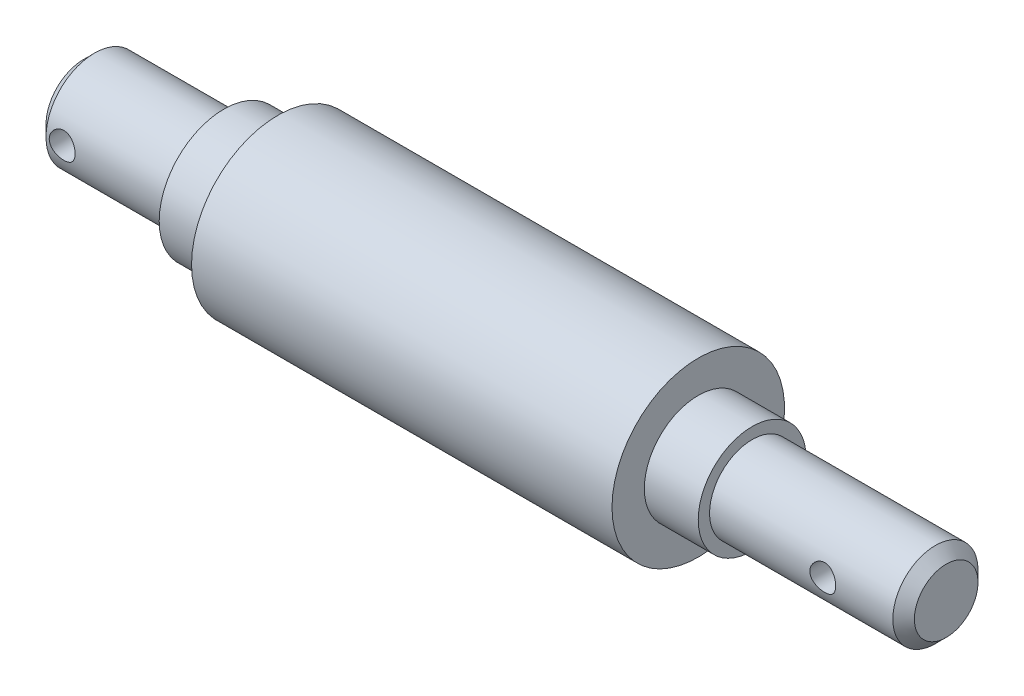
ISO-10303-21;
HEADER;
FILE_DESCRIPTION(('STEP AP214'),'2;1');
FILE_NAME('part.step','',(''),(''),'','','');
FILE_SCHEMA(('AUTOMOTIVE_DESIGN { 1 0 10303 214 1 1 1 1 }'));
ENDSEC;
DATA;
#1=APPLICATION_CONTEXT('core data for automotive mechanical design processes');
#2=APPLICATION_PROTOCOL_DEFINITION('international standard','automotive_design',2000,#1);
#3=PRODUCT_CONTEXT('',#1,'mechanical');
#4=PRODUCT('Part','Part','',(#3));
#5=PRODUCT_RELATED_PRODUCT_CATEGORY('part','',(#4));
#6=PRODUCT_DEFINITION_FORMATION('','',#4);
#7=PRODUCT_DEFINITION_CONTEXT('part definition',#1,'design');
#8=PRODUCT_DEFINITION('design','',#6,#7);
#9=PRODUCT_DEFINITION_SHAPE('','',#8);
#10=(LENGTH_UNIT() NAMED_UNIT(*) SI_UNIT(.MILLI.,.METRE.));
#11=(NAMED_UNIT(*) PLANE_ANGLE_UNIT() SI_UNIT($,.RADIAN.));
#12=(NAMED_UNIT(*) SI_UNIT($,.STERADIAN.) SOLID_ANGLE_UNIT());
#13=UNCERTAINTY_MEASURE_WITH_UNIT(LENGTH_MEASURE(1.E-05),#10,'distance_accuracy_value','');
#14=(GEOMETRIC_REPRESENTATION_CONTEXT(3) GLOBAL_UNCERTAINTY_ASSIGNED_CONTEXT((#13)) GLOBAL_UNIT_ASSIGNED_CONTEXT((#10,
#11,#12)) REPRESENTATION_CONTEXT('',''));
#15=CARTESIAN_POINT('',(0.,0.,0.));
#16=DIRECTION('',(0.,0.,1.));
#17=DIRECTION('',(1.,0.,0.));
#18=AXIS2_PLACEMENT_3D('',#15,#16,#17);
#19=CARTESIAN_POINT('',(-41.319098712356,0.,0.));
#20=DIRECTION('',(1.,0.,0.));
#21=DIRECTION('',(0.,0.,-1.));
#22=AXIS2_PLACEMENT_3D('',#19,#20,#21);
#23=PLANE('',#22);
#24=CARTESIAN_POINT('',(-41.319098712356,0.,0.));
#25=DIRECTION('',(1.,0.,0.));
#26=DIRECTION('',(0.,0.,-1.));
#27=AXIS2_PLACEMENT_3D('',#24,#25,#26);
#28=CIRCLE('',#27,3.49999999999999);
#29=CARTESIAN_POINT('',(-41.319098712356,0.,-3.49999999999999));
#30=VERTEX_POINT('',#29);
#31=EDGE_CURVE('E171',#30,#30,#28,.F.);
#32=ORIENTED_EDGE('',*,*,#31,.T.);
#33=EDGE_LOOP('',(#32));
#34=FACE_BOUND('',#33,.T.);
#35=ADVANCED_FACE('F39',(#34),#23,.F.);
#36=CARTESIAN_POINT('',(-41.319098712356,0.,0.));
#37=DIRECTION('',(-1.,0.,0.));
#38=DIRECTION('',(0.,0.,1.));
#39=AXIS2_PLACEMENT_3D('',#36,#37,#38);
#40=CYLINDRICAL_SURFACE('',#39,4.5);
#41=CARTESIAN_POINT('',(-37.619098712356,0.,4.5));
#42=CARTESIAN_POINT('',(-37.6191002825169,-0.0661527334997126,4.49999900286097));
#43=CARTESIAN_POINT('',(-37.6245872808698,-0.132322296133104,4.49852691697293));
#44=CARTESIAN_POINT('',(-37.6463514507992,-0.262755270812679,4.49279744172994));
#45=CARTESIAN_POINT('',(-37.6626338150117,-0.327017749991453,4.48853871199544));
#46=CARTESIAN_POINT('',(-37.7054217124744,-0.451734953427189,4.47770599951682));
#47=CARTESIAN_POINT('',(-37.7319140649556,-0.512194470609173,4.47113500278253));
#48=CARTESIAN_POINT('',(-37.794321057956,-0.627812211835596,4.45637219490979));
#49=CARTESIAN_POINT('',(-37.8302363263716,-0.682970082269774,4.44818027577004));
#50=CARTESIAN_POINT('',(-37.9113488222041,-0.787697702244017,4.43084768941303));
#51=CARTESIAN_POINT('',(-37.9567239131611,-0.83712701391769,4.4216908060761));
#52=CARTESIAN_POINT('',(-38.0550878021939,-0.92777228196381,4.40356445807354));
#53=CARTESIAN_POINT('',(-38.1080775789261,-0.968987180973926,4.39459501766848));
#54=CARTESIAN_POINT('',(-38.2212876532518,-1.04271845546055,4.37769322480147));
#55=CARTESIAN_POINT('',(-38.2816165093149,-1.07507326641916,4.36978133143675));
#56=CARTESIAN_POINT('',(-38.4071027790097,-1.12912528846172,4.35612886385181));
#57=CARTESIAN_POINT('',(-38.4722592997482,-1.15082446470732,4.3503878893056));
#58=CARTESIAN_POINT('',(-38.603996035052,-1.18246152135855,4.34189469502391));
#59=CARTESIAN_POINT('',(-38.6705108363273,-1.19265402146962,4.33907788764184));
#60=CARTESIAN_POINT('',(-38.8043613223558,-1.20178220823656,4.33655898626814));
#61=CARTESIAN_POINT('',(-38.8716968513774,-1.20071999823441,4.33685631029042));
#62=CARTESIAN_POINT('',(-39.0032899615794,-1.18757106001573,4.34047427261428));
#63=CARTESIAN_POINT('',(-39.0675810215788,-1.17579243638846,4.34371041301614));
#64=CARTESIAN_POINT('',(-39.19323971303,-1.14203849233322,4.35270607853718));
#65=CARTESIAN_POINT('',(-39.2546071104013,-1.120062356958,4.35846580532997));
#66=CARTESIAN_POINT('',(-39.3734795986411,-1.0662861417915,4.37193397047586));
#67=CARTESIAN_POINT('',(-39.4309333159278,-1.0343780468267,4.37966365690834));
#68=CARTESIAN_POINT('',(-39.539779207667,-0.961719022942674,4.39618937785855));
#69=CARTESIAN_POINT('',(-39.5911701858499,-0.920966353345509,4.40498562213217));
#70=CARTESIAN_POINT('',(-39.6881921108289,-0.830199643580509,4.42300506377809));
#71=CARTESIAN_POINT('',(-39.733580503345,-0.779926876369793,4.43223282893269));
#72=CARTESIAN_POINT('',(-39.8153319805662,-0.672370600923823,4.44981828765819));
#73=CARTESIAN_POINT('',(-39.8516947095775,-0.615086816523053,4.45817594693141));
#74=CARTESIAN_POINT('',(-39.9144694540508,-0.494758953298469,4.47313092238968));
#75=CARTESIAN_POINT('',(-39.9408375746252,-0.431690941531073,4.47972043700134));
#76=CARTESIAN_POINT('',(-39.982527025644,-0.301801376634237,4.49034026640601));
#77=CARTESIAN_POINT('',(-39.9978507699904,-0.234980647156994,4.4943711404025));
#78=CARTESIAN_POINT('',(-40.0166356385067,-0.101552449887308,4.4993349513503));
#79=CARTESIAN_POINT('',(-40.0204265362665,-0.0349945425848269,4.50035398482577));
#80=CARTESIAN_POINT('',(-40.0169488138079,0.0978060275407194,4.49942683015015));
#81=CARTESIAN_POINT('',(-40.0096813366926,0.164048722237267,4.49748094848206));
#82=CARTESIAN_POINT('',(-39.98456364388,0.29316146994107,4.49089821297618));
#83=CARTESIAN_POINT('',(-39.9668973646373,0.356069911216676,4.4863081592782));
#84=CARTESIAN_POINT('',(-39.9216971456513,0.478024182705637,4.47495776936461));
#85=CARTESIAN_POINT('',(-39.8941621366057,0.5370695935296,4.46819719797615));
#86=CARTESIAN_POINT('',(-39.8293943800476,0.65090308480079,4.45305396335801));
#87=CARTESIAN_POINT('',(-39.7919822322772,0.705585113076781,4.4446421196329));
#88=CARTESIAN_POINT('',(-39.7087477342614,0.808010781238218,4.42716871419022));
#89=CARTESIAN_POINT('',(-39.6629237227962,0.855753047279247,4.41810702435333));
#90=CARTESIAN_POINT('',(-39.5626273658585,0.944333546872912,4.40003847521235));
#91=CARTESIAN_POINT('',(-39.5079475755159,0.984939115499913,4.39104036862172));
#92=CARTESIAN_POINT('',(-39.3923598946992,1.05640314710969,4.37439868305052));
#93=CARTESIAN_POINT('',(-39.3314522641938,1.08726201672916,4.36675504756664));
#94=CARTESIAN_POINT('',(-39.2054415281031,1.13812446951892,4.3537756104099));
#95=CARTESIAN_POINT('',(-39.1403652252321,1.15819087353539,4.3484264905424));
#96=CARTESIAN_POINT('',(-39.0075951205157,1.18704723072476,4.34063895139314));
#97=CARTESIAN_POINT('',(-38.9399019921358,1.19584006561793,4.33819978828692));
#98=CARTESIAN_POINT('',(-38.8062018396325,1.20173393791952,4.33657046728011));
#99=CARTESIAN_POINT('',(-38.7402123202029,1.19920893370791,4.33727638641619));
#100=CARTESIAN_POINT('',(-38.6096366039482,1.18340625600337,4.34161437652976));
#101=CARTESIAN_POINT('',(-38.5450503710552,1.17012885921035,4.34524637220818));
#102=CARTESIAN_POINT('',(-38.4195852610786,1.133415094198,4.35496542642749));
#103=CARTESIAN_POINT('',(-38.3586816067168,1.11005796645342,4.36103331011479));
#104=CARTESIAN_POINT('',(-38.2416114140354,1.05390932737436,4.37494090882014));
#105=CARTESIAN_POINT('',(-38.1854456205757,1.02111633614771,4.38278090172902));
#106=CARTESIAN_POINT('',(-38.0776604966581,0.945893455612883,4.3996375286419));
#107=CARTESIAN_POINT('',(-38.0262235913703,0.903208378607449,4.40868199860991));
#108=CARTESIAN_POINT('',(-37.9311212413556,0.8098983210666,4.42677302269828));
#109=CARTESIAN_POINT('',(-37.8874576891547,0.759271412615244,4.43581957679071));
#110=CARTESIAN_POINT('',(-37.8082233697679,0.650207988653203,4.45312687442375));
#111=CARTESIAN_POINT('',(-37.7728457059664,0.59162757705106,4.46136666788729));
#112=CARTESIAN_POINT('',(-37.7124962627984,0.469133184250127,4.4759028606174));
#113=CARTESIAN_POINT('',(-37.6875178069578,0.405222656817772,4.48220050610157));
#114=CARTESIAN_POINT('',(-37.6519335411067,0.28462482292859,4.4913285150808));
#115=CARTESIAN_POINT('',(-37.6396490822005,0.228457209939017,4.49455662355561));
#116=CARTESIAN_POINT('',(-37.6232313886558,0.114863877190244,4.49889269421873));
#117=CARTESIAN_POINT('',(-37.619097349036,0.0574382822429151,4.50000086578362));
#118=CARTESIAN_POINT('',(-37.619098712356,0.,4.5));
#119=B_SPLINE_CURVE_WITH_KNOTS('',3,(#41,#42,#43,#44,#45,#46,#47,#48,#49,#50,#51,#52,#53,#54,
#55,#56,#57,#58,#59,#60,#61,#62,#63,#64,#65,#66,#67,#68,#69,#70,#71,#72,#73,#74,#75,#76,#77,#78,
#79,#80,#81,#82,#83,#84,#85,#86,#87,#88,#89,#90,#91,#92,#93,#94,#95,#96,#97,#98,#99,#100,#101,
#102,#103,#104,#105,#106,#107,#108,#109,#110,#111,#112,#113,#114,#115,#116,#117,#118),
.UNSPECIFIED.,.T.,.F.,(4,2,2,2,2,2,2,2,2,2,2,2,2,2,2,2,2,2,2,2,2,2,2,2,2,2,2,2,2,2,2,2,2,2,2,2,
2,2,4),(0.,0.198247559369741,0.396590546256871,0.594678331783162,0.792779320252053,
0.995009387729807,1.19726546955089,1.40299549513937,1.6086875647782,1.80973294948553,
2.01074076239091,2.20614601224097,2.40156688084263,2.59919204004398,2.79685612867077,
3.00096755883892,3.20508703159057,3.41009285758324,3.61505386310582,3.81409630511227,
4.01311817351709,4.20872121381768,4.40434545461868,4.60380171599229,4.80329740951831,
5.00841897826171,5.21353198810963,5.41743778614894,5.62129145192296,5.81846005436074,
6.01562358306263,6.21126459262889,6.40693630267708,6.6083660373674,6.80984474593376,
7.01563351362446,7.22128995681015,7.39343891389909,7.56557086773736),.UNSPECIFIED.);
#120=CARTESIAN_POINT('',(-37.619098712356,0.,4.5));
#121=VERTEX_POINT('',#120);
#122=EDGE_CURVE('E44',#121,#121,#119,.T.);
#123=ORIENTED_EDGE('',*,*,#122,.T.);
#124=EDGE_LOOP('',(#123));
#125=FACE_BOUND('',#124,.T.);
#126=CARTESIAN_POINT('',(-37.619098712356,0.,-4.5));
#127=CARTESIAN_POINT('',(-37.6191002825169,0.0661527334997126,-4.49999900286097));
#128=CARTESIAN_POINT('',(-37.6245872808698,0.132322296133104,-4.49852691697293));
#129=CARTESIAN_POINT('',(-37.6463514507992,0.262755270812679,-4.49279744172994));
#130=CARTESIAN_POINT('',(-37.6626338150117,0.327017749991453,-4.48853871199544));
#131=CARTESIAN_POINT('',(-37.7054217124744,0.451734953427189,-4.47770599951682));
#132=CARTESIAN_POINT('',(-37.7319140649556,0.512194470609173,-4.47113500278253));
#133=CARTESIAN_POINT('',(-37.794321057956,0.627812211835596,-4.45637219490979));
#134=CARTESIAN_POINT('',(-37.8302363263716,0.682970082269774,-4.44818027577004));
#135=CARTESIAN_POINT('',(-37.9113488222041,0.787697702244017,-4.43084768941303));
#136=CARTESIAN_POINT('',(-37.9567239131611,0.83712701391769,-4.4216908060761));
#137=CARTESIAN_POINT('',(-38.0550878021939,0.92777228196381,-4.40356445807354));
#138=CARTESIAN_POINT('',(-38.1080775789261,0.968987180973926,-4.39459501766848));
#139=CARTESIAN_POINT('',(-38.2212876532518,1.04271845546055,-4.37769322480147));
#140=CARTESIAN_POINT('',(-38.2816165093149,1.07507326641916,-4.36978133143675));
#141=CARTESIAN_POINT('',(-38.4071027790097,1.12912528846172,-4.35612886385181));
#142=CARTESIAN_POINT('',(-38.4722592997482,1.15082446470732,-4.3503878893056));
#143=CARTESIAN_POINT('',(-38.603996035052,1.18246152135855,-4.34189469502391));
#144=CARTESIAN_POINT('',(-38.6705108363273,1.19265402146962,-4.33907788764184));
#145=CARTESIAN_POINT('',(-38.8043613223558,1.20178220823656,-4.33655898626814));
#146=CARTESIAN_POINT('',(-38.8716968513774,1.20071999823441,-4.33685631029042));
#147=CARTESIAN_POINT('',(-39.0032899615794,1.18757106001573,-4.34047427261428));
#148=CARTESIAN_POINT('',(-39.0675810215788,1.17579243638846,-4.34371041301614));
#149=CARTESIAN_POINT('',(-39.19323971303,1.14203849233322,-4.35270607853718));
#150=CARTESIAN_POINT('',(-39.2546071104013,1.120062356958,-4.35846580532997));
#151=CARTESIAN_POINT('',(-39.3734795986411,1.0662861417915,-4.37193397047586));
#152=CARTESIAN_POINT('',(-39.4309333159278,1.0343780468267,-4.37966365690834));
#153=CARTESIAN_POINT('',(-39.539779207667,0.961719022942674,-4.39618937785855));
#154=CARTESIAN_POINT('',(-39.5911701858499,0.920966353345509,-4.40498562213217));
#155=CARTESIAN_POINT('',(-39.6881921108289,0.830199643580509,-4.42300506377809));
#156=CARTESIAN_POINT('',(-39.733580503345,0.779926876369793,-4.43223282893269));
#157=CARTESIAN_POINT('',(-39.8153319805662,0.672370600923823,-4.44981828765819));
#158=CARTESIAN_POINT('',(-39.8516947095775,0.615086816523053,-4.45817594693141));
#159=CARTESIAN_POINT('',(-39.9144694540508,0.494758953298469,-4.47313092238968));
#160=CARTESIAN_POINT('',(-39.9408375746252,0.431690941531073,-4.47972043700134));
#161=CARTESIAN_POINT('',(-39.982527025644,0.301801376634237,-4.49034026640601));
#162=CARTESIAN_POINT('',(-39.9978507699904,0.234980647156994,-4.4943711404025));
#163=CARTESIAN_POINT('',(-40.0166356385067,0.101552449887308,-4.4993349513503));
#164=CARTESIAN_POINT('',(-40.0204265362665,0.0349945425848269,-4.50035398482577));
#165=CARTESIAN_POINT('',(-40.0169488138079,-0.0978060275407194,-4.49942683015015));
#166=CARTESIAN_POINT('',(-40.0096813366926,-0.164048722237267,-4.49748094848206));
#167=CARTESIAN_POINT('',(-39.98456364388,-0.29316146994107,-4.49089821297618));
#168=CARTESIAN_POINT('',(-39.9668973646373,-0.356069911216676,-4.4863081592782));
#169=CARTESIAN_POINT('',(-39.9216971456513,-0.478024182705637,-4.47495776936461));
#170=CARTESIAN_POINT('',(-39.8941621366057,-0.5370695935296,-4.46819719797615));
#171=CARTESIAN_POINT('',(-39.8293943800476,-0.65090308480079,-4.45305396335801));
#172=CARTESIAN_POINT('',(-39.7919822322772,-0.705585113076781,-4.4446421196329));
#173=CARTESIAN_POINT('',(-39.7087477342614,-0.808010781238218,-4.42716871419022));
#174=CARTESIAN_POINT('',(-39.6629237227962,-0.855753047279247,-4.41810702435333));
#175=CARTESIAN_POINT('',(-39.5626273658585,-0.944333546872912,-4.40003847521235));
#176=CARTESIAN_POINT('',(-39.5079475755159,-0.984939115499913,-4.39104036862172));
#177=CARTESIAN_POINT('',(-39.3923598946992,-1.05640314710969,-4.37439868305052));
#178=CARTESIAN_POINT('',(-39.3314522641938,-1.08726201672916,-4.36675504756664));
#179=CARTESIAN_POINT('',(-39.2054415281031,-1.13812446951892,-4.3537756104099));
#180=CARTESIAN_POINT('',(-39.1403652252321,-1.15819087353539,-4.3484264905424));
#181=CARTESIAN_POINT('',(-39.0075951205157,-1.18704723072476,-4.34063895139314));
#182=CARTESIAN_POINT('',(-38.9399019921358,-1.19584006561793,-4.33819978828692));
#183=CARTESIAN_POINT('',(-38.8062018396325,-1.20173393791952,-4.33657046728011));
#184=CARTESIAN_POINT('',(-38.7402123202029,-1.19920893370791,-4.33727638641619));
#185=CARTESIAN_POINT('',(-38.6096366039482,-1.18340625600337,-4.34161437652976));
#186=CARTESIAN_POINT('',(-38.5450503710552,-1.17012885921035,-4.34524637220818));
#187=CARTESIAN_POINT('',(-38.4195852610786,-1.133415094198,-4.35496542642749));
#188=CARTESIAN_POINT('',(-38.3586816067168,-1.11005796645342,-4.36103331011479));
#189=CARTESIAN_POINT('',(-38.2416114140354,-1.05390932737436,-4.37494090882014));
#190=CARTESIAN_POINT('',(-38.1854456205757,-1.02111633614771,-4.38278090172902));
#191=CARTESIAN_POINT('',(-38.0776604966581,-0.945893455612883,-4.3996375286419));
#192=CARTESIAN_POINT('',(-38.0262235913703,-0.903208378607449,-4.40868199860991));
#193=CARTESIAN_POINT('',(-37.9311212413556,-0.8098983210666,-4.42677302269828));
#194=CARTESIAN_POINT('',(-37.8874576891547,-0.759271412615244,-4.43581957679071));
#195=CARTESIAN_POINT('',(-37.8082233697679,-0.650207988653203,-4.45312687442375));
#196=CARTESIAN_POINT('',(-37.7728457059664,-0.59162757705106,-4.46136666788729));
#197=CARTESIAN_POINT('',(-37.7124962627984,-0.469133184250127,-4.4759028606174));
#198=CARTESIAN_POINT('',(-37.6875178069578,-0.405222656817772,-4.48220050610157));
#199=CARTESIAN_POINT('',(-37.6519335411067,-0.28462482292859,-4.4913285150808));
#200=CARTESIAN_POINT('',(-37.6396490822005,-0.228457209939017,-4.49455662355561));
#201=CARTESIAN_POINT('',(-37.6232313886558,-0.114863877190244,-4.49889269421873));
#202=CARTESIAN_POINT('',(-37.619097349036,-0.0574382822429151,-4.50000086578362));
#203=CARTESIAN_POINT('',(-37.619098712356,0.,-4.5));
#204=B_SPLINE_CURVE_WITH_KNOTS('',3,(#126,#127,#128,#129,#130,#131,#132,#133,#134,#135,#136,
#137,#138,#139,#140,#141,#142,#143,#144,#145,#146,#147,#148,#149,#150,#151,#152,#153,#154,#155,
#156,#157,#158,#159,#160,#161,#162,#163,#164,#165,#166,#167,#168,#169,#170,#171,#172,#173,#174,
#175,#176,#177,#178,#179,#180,#181,#182,#183,#184,#185,#186,#187,#188,#189,#190,#191,#192,#193,
#194,#195,#196,#197,#198,#199,#200,#201,#202,#203),.UNSPECIFIED.,.T.,.F.,(4,2,2,2,2,2,2,2,2,2,2,
2,2,2,2,2,2,2,2,2,2,2,2,2,2,2,2,2,2,2,2,2,2,2,2,2,2,2,4),(0.,0.198247559369741,
0.396590546256871,0.594678331783162,0.792779320252053,0.995009387729807,1.19726546955089,
1.40299549513937,1.6086875647782,1.80973294948553,2.01074076239091,2.20614601224097,
2.40156688084263,2.59919204004398,2.79685612867077,3.00096755883892,3.20508703159057,
3.41009285758324,3.61505386310582,3.81409630511227,4.01311817351709,4.20872121381768,
4.40434545461868,4.60380171599229,4.80329740951831,5.00841897826171,5.21353198810963,
5.41743778614894,5.62129145192296,5.81846005436074,6.01562358306263,6.21126459262889,
6.40693630267708,6.6083660373674,6.80984474593376,7.01563351362446,7.22128995681015,
7.39343891389909,7.56557086773736),.UNSPECIFIED.);
#205=CARTESIAN_POINT('',(-37.619098712356,0.,-4.5));
#206=VERTEX_POINT('',#205);
#207=EDGE_CURVE('E117',#206,#206,#204,.T.);
#208=ORIENTED_EDGE('',*,*,#207,.T.);
#209=EDGE_LOOP('',(#208));
#210=FACE_BOUND('',#209,.T.);
#211=CARTESIAN_POINT('',(-40.319098712356,0.,0.));
#212=DIRECTION('',(1.,0.,0.));
#213=DIRECTION('',(0.,0.,-1.));
#214=AXIS2_PLACEMENT_3D('',#211,#212,#213);
#215=CIRCLE('',#214,4.5);
#216=CARTESIAN_POINT('',(-40.319098712356,0.,-4.5));
#217=VERTEX_POINT('',#216);
#218=EDGE_CURVE('E60',#217,#217,#215,.T.);
#219=ORIENTED_EDGE('',*,*,#218,.T.);
#220=EDGE_LOOP('',(#219));
#221=FACE_BOUND('',#220,.T.);
#222=CARTESIAN_POINT('',(-28.3334978231815,0.,0.));
#223=DIRECTION('',(-1.,0.,0.));
#224=DIRECTION('',(0.,0.,1.));
#225=AXIS2_PLACEMENT_3D('',#222,#223,#224);
#226=CIRCLE('',#225,4.5);
#227=CARTESIAN_POINT('',(-28.3334978231815,0.,4.5));
#228=VERTEX_POINT('',#227);
#229=EDGE_CURVE('E167',#228,#228,#226,.T.);
#230=ORIENTED_EDGE('',*,*,#229,.T.);
#231=EDGE_LOOP('',(#230));
#232=FACE_BOUND('',#231,.T.);
#233=ADVANCED_FACE('F99',(#125,#210,#221,#232),#40,.T.);
#234=CARTESIAN_POINT('',(-28.319098712356,0.,0.));
#235=DIRECTION('',(1.,0.,0.));
#236=DIRECTION('',(0.,0.,-1.));
#237=AXIS2_PLACEMENT_3D('',#234,#235,#236);
#238=CONICAL_SURFACE('',#237,5.99993088694361,1.56119677214311);
#239=ORIENTED_EDGE('',*,*,#229,.F.);
#240=EDGE_LOOP('',(#239));
#241=FACE_BOUND('',#240,.T.);
#242=CARTESIAN_POINT('',(-28.319098712356,0.,0.));
#243=DIRECTION('',(-1.,0.,0.));
#244=DIRECTION('',(0.,0.,1.));
#245=AXIS2_PLACEMENT_3D('',#242,#243,#244);
#246=CIRCLE('',#245,5.99993088694361);
#247=CARTESIAN_POINT('',(-28.319098712356,0.,5.99993088694361));
#248=VERTEX_POINT('',#247);
#249=EDGE_CURVE('E163',#248,#248,#246,.T.);
#250=ORIENTED_EDGE('',*,*,#249,.T.);
#251=EDGE_LOOP('',(#250));
#252=FACE_BOUND('',#251,.T.);
#253=ADVANCED_FACE('F105',(#241,#252),#238,.T.);
#254=CARTESIAN_POINT('',(-41.319098712356,0.,0.));
#255=DIRECTION('',(-1.,0.,0.));
#256=DIRECTION('',(0.,0.,1.));
#257=AXIS2_PLACEMENT_3D('',#254,#255,#256);
#258=CYLINDRICAL_SURFACE('',#257,5.99993088694361);
#259=ORIENTED_EDGE('',*,*,#249,.F.);
#260=EDGE_LOOP('',(#259));
#261=FACE_BOUND('',#260,.T.);
#262=CARTESIAN_POINT('',(-23.319098712356,0.,0.));
#263=DIRECTION('',(-1.,0.,0.));
#264=DIRECTION('',(0.,0.,1.));
#265=AXIS2_PLACEMENT_3D('',#262,#263,#264);
#266=CIRCLE('',#265,5.99993088694361);
#267=CARTESIAN_POINT('',(-23.319098712356,0.,5.99993088694361));
#268=VERTEX_POINT('',#267);
#269=EDGE_CURVE('E159',#268,#268,#266,.T.);
#270=ORIENTED_EDGE('',*,*,#269,.T.);
#271=EDGE_LOOP('',(#270));
#272=FACE_BOUND('',#271,.T.);
#273=ADVANCED_FACE('F184',(#261,#272),#258,.T.);
#274=CARTESIAN_POINT('',(-23.319098712356,5.99993088694361,0.));
#275=DIRECTION('',(1.,0.,0.));
#276=DIRECTION('',(0.,0.,-1.));
#277=AXIS2_PLACEMENT_3D('',#274,#275,#276);
#278=PLANE('',#277);
#279=ORIENTED_EDGE('',*,*,#269,.F.);
#280=EDGE_LOOP('',(#279));
#281=FACE_BOUND('',#280,.T.);
#282=CARTESIAN_POINT('',(-23.319098712356,0.,0.));
#283=DIRECTION('',(-1.,0.,0.));
#284=DIRECTION('',(0.,0.,1.));
#285=AXIS2_PLACEMENT_3D('',#282,#283,#284);
#286=CIRCLE('',#285,8.);
#287=CARTESIAN_POINT('',(-23.319098712356,0.,8.));
#288=VERTEX_POINT('',#287);
#289=EDGE_CURVE('E155',#288,#288,#286,.T.);
#290=ORIENTED_EDGE('',*,*,#289,.T.);
#291=EDGE_LOOP('',(#290));
#292=FACE_BOUND('',#291,.T.);
#293=ADVANCED_FACE('F189',(#281,#292),#278,.F.);
#294=CARTESIAN_POINT('',(-41.319098712356,0.,0.));
#295=DIRECTION('',(-1.,0.,0.));
#296=DIRECTION('',(0.,0.,1.));
#297=AXIS2_PLACEMENT_3D('',#294,#295,#296);
#298=CYLINDRICAL_SURFACE('',#297,8.);
#299=ORIENTED_EDGE('',*,*,#289,.F.);
#300=EDGE_LOOP('',(#299));
#301=FACE_BOUND('',#300,.T.);
#302=CARTESIAN_POINT('',(15.680901287644,0.,0.));
#303=DIRECTION('',(-1.,0.,0.));
#304=DIRECTION('',(0.,0.,1.));
#305=AXIS2_PLACEMENT_3D('',#302,#303,#304);
#306=CIRCLE('',#305,8.);
#307=CARTESIAN_POINT('',(15.680901287644,0.,8.));
#308=VERTEX_POINT('',#307);
#309=EDGE_CURVE('E151',#308,#308,#306,.T.);
#310=ORIENTED_EDGE('',*,*,#309,.T.);
#311=EDGE_LOOP('',(#310));
#312=FACE_BOUND('',#311,.T.);
#313=ADVANCED_FACE('F194',(#301,#312),#298,.T.);
#314=CARTESIAN_POINT('',(15.680901287644,8.,0.));
#315=DIRECTION('',(-1.,0.,0.));
#316=DIRECTION('',(0.,0.,1.));
#317=AXIS2_PLACEMENT_3D('',#314,#315,#316);
#318=PLANE('',#317);
#319=ORIENTED_EDGE('',*,*,#309,.F.);
#320=EDGE_LOOP('',(#319));
#321=FACE_BOUND('',#320,.T.);
#322=CARTESIAN_POINT('',(15.680901287644,0.,0.));
#323=DIRECTION('',(-1.,0.,0.));
#324=DIRECTION('',(0.,0.,1.));
#325=AXIS2_PLACEMENT_3D('',#322,#323,#324);
#326=CIRCLE('',#325,5.);
#327=CARTESIAN_POINT('',(15.680901287644,0.,5.));
#328=VERTEX_POINT('',#327);
#329=EDGE_CURVE('E145',#328,#328,#326,.T.);
#330=ORIENTED_EDGE('',*,*,#329,.T.);
#331=EDGE_LOOP('',(#330));
#332=FACE_BOUND('',#331,.T.);
#333=ADVANCED_FACE('F200',(#321,#332),#318,.F.);
#334=CARTESIAN_POINT('',(-41.319098712356,0.,0.));
#335=DIRECTION('',(-1.,0.,0.));
#336=DIRECTION('',(0.,0.,1.));
#337=AXIS2_PLACEMENT_3D('',#334,#335,#336);
#338=CYLINDRICAL_SURFACE('',#337,5.);
#339=ORIENTED_EDGE('',*,*,#329,.F.);
#340=EDGE_LOOP('',(#339));
#341=FACE_BOUND('',#340,.T.);
#342=CARTESIAN_POINT('',(20.680901287644,0.,0.));
#343=DIRECTION('',(-1.,0.,0.));
#344=DIRECTION('',(0.,0.,1.));
#345=AXIS2_PLACEMENT_3D('',#342,#343,#344);
#346=CIRCLE('',#345,5.);
#347=CARTESIAN_POINT('',(20.680901287644,0.,5.));
#348=VERTEX_POINT('',#347);
#349=EDGE_CURVE('E141',#348,#348,#346,.T.);
#350=ORIENTED_EDGE('',*,*,#349,.T.);
#351=EDGE_LOOP('',(#350));
#352=FACE_BOUND('',#351,.T.);
#353=ADVANCED_FACE('F206',(#341,#352),#338,.T.);
#354=CARTESIAN_POINT('',(20.680901287644,5.,0.));
#355=DIRECTION('',(-1.,0.,0.));
#356=DIRECTION('',(0.,0.,1.));
#357=AXIS2_PLACEMENT_3D('',#354,#355,#356);
#358=PLANE('',#357);
#359=ORIENTED_EDGE('',*,*,#349,.F.);
#360=EDGE_LOOP('',(#359));
#361=FACE_BOUND('',#360,.T.);
#362=CARTESIAN_POINT('',(20.680901287644,0.,0.));
#363=DIRECTION('',(-1.,0.,0.));
#364=DIRECTION('',(0.,0.,1.));
#365=AXIS2_PLACEMENT_3D('',#362,#363,#364);
#366=CIRCLE('',#365,3.95);
#367=CARTESIAN_POINT('',(20.680901287644,0.,3.95));
#368=VERTEX_POINT('',#367);
#369=EDGE_CURVE('E128',#368,#368,#366,.T.);
#370=ORIENTED_EDGE('',*,*,#369,.T.);
#371=EDGE_LOOP('',(#370));
#372=FACE_BOUND('',#371,.T.);
#373=ADVANCED_FACE('F96',(#361,#372),#358,.F.);
#374=CARTESIAN_POINT('',(-41.319098712356,0.,0.));
#375=DIRECTION('',(-1.,0.,0.));
#376=DIRECTION('',(0.,0.,1.));
#377=AXIS2_PLACEMENT_3D('',#374,#375,#376);
#378=CYLINDRICAL_SURFACE('',#377,3.95);
#379=CARTESIAN_POINT('',(32.380901287644,0.,3.95));
#380=CARTESIAN_POINT('',(32.380900596711,-0.0657921053393094,3.94999950148961));
#381=CARTESIAN_POINT('',(32.3754726299522,-0.131591214838203,3.94834057311497));
#382=CARTESIAN_POINT('',(32.3539573204322,-0.261270865350392,3.94188498697175));
#383=CARTESIAN_POINT('',(32.3378670295636,-0.325150870627959,3.93708746139313));
#384=CARTESIAN_POINT('',(32.2956156578604,-0.449103270402122,3.92487988296748));
#385=CARTESIAN_POINT('',(32.2694696552803,-0.509181209664436,3.91747374305666));
#386=CARTESIAN_POINT('',(32.2079115784995,-0.624100282433897,3.90081718663398));
#387=CARTESIAN_POINT('',(32.1724982021667,-0.678940678549644,3.89156651099519));
#388=CARTESIAN_POINT('',(32.0923152170941,-0.783438437222783,3.87190239177238));
#389=CARTESIAN_POINT('',(32.0473228957252,-0.832920325244442,3.86146466337096));
#390=CARTESIAN_POINT('',(31.9497337181627,-0.92376525550519,3.84074643294284));
#391=CARTESIAN_POINT('',(31.8971355451698,-0.965126888957121,3.83046595848297));
#392=CARTESIAN_POINT('',(31.7843326875358,-1.03948900030352,3.81096820781044));
#393=CARTESIAN_POINT('',(31.7239801207606,-1.07227379069013,3.80178104820255));
#394=CARTESIAN_POINT('',(31.5982940800103,-1.12715664878843,3.78587377700205));
#395=CARTESIAN_POINT('',(31.5329618412968,-1.14925735687914,3.77915305597244));
#396=CARTESIAN_POINT('',(31.4011443718499,-1.18150913793117,3.76919296296909));
#397=CARTESIAN_POINT('',(31.3347457509141,-1.19198431895654,3.76585939822972));
#398=CARTESIAN_POINT('',(31.2010562727978,-1.20169991107966,3.76277100880304));
#399=CARTESIAN_POINT('',(31.1337656422091,-1.2009431227263,3.76301529202458));
#400=CARTESIAN_POINT('',(31.0028514447063,-1.18847050815708,3.76697161773738));
#401=CARTESIAN_POINT('',(30.9391844736981,-1.17716250700931,3.7705546058486));
#402=CARTESIAN_POINT('',(30.8146977587935,-1.14456806673585,3.78057558453503));
#403=CARTESIAN_POINT('',(30.7538783030372,-1.12328062017981,3.7870138633498));
#404=CARTESIAN_POINT('',(30.6358233429325,-1.07103490290144,3.80212175360937));
#405=CARTESIAN_POINT('',(30.5786498071879,-1.03994563160965,3.81082129239326));
#406=CARTESIAN_POINT('',(30.4701954252245,-0.96906980309006,3.82945730084039));
#407=CARTESIAN_POINT('',(30.4189160430111,-0.929281092164102,3.8393940765405));
#408=CARTESIAN_POINT('',(30.3213947329989,-0.840117660833617,3.8599066294146));
#409=CARTESIAN_POINT('',(30.275463135909,-0.790405027053193,3.87049153542939));
#410=CARTESIAN_POINT('',(30.1925154299109,-0.683850928056148,3.89073062210331));
#411=CARTESIAN_POINT('',(30.155499911052,-0.627008991414032,3.90038474113935));
#412=CARTESIAN_POINT('',(30.0912401615307,-0.507235607809544,3.9177665299574));
#413=CARTESIAN_POINT('',(30.0640663258457,-0.444264225815921,3.92548020503653));
#414=CARTESIAN_POINT('',(30.0207875664107,-0.314356032727487,3.93801108754001));
#415=CARTESIAN_POINT('',(30.0046794734835,-0.247420362956447,3.94282912421219));
#416=CARTESIAN_POINT('',(29.9845096904804,-0.114120636053938,3.94889402423303));
#417=CARTESIAN_POINT('',(29.9800275557898,-0.0478257706930836,3.95026547137128));
#418=CARTESIAN_POINT('',(29.9820563754786,0.0845739664892934,3.94964905795108));
#419=CARTESIAN_POINT('',(29.9885658211727,0.150678863138098,3.94766165842204));
#420=CARTESIAN_POINT('',(30.0120537722881,0.27922484371854,3.94063250926792));
#421=CARTESIAN_POINT('',(30.028785251003,0.341715383064607,3.93566287748284));
#422=CARTESIAN_POINT('',(30.0719438511727,0.462987512144251,3.9232462867588));
#423=CARTESIAN_POINT('',(30.0983721484581,0.521768651064545,3.91579902739437));
#424=CARTESIAN_POINT('',(30.1608712181795,0.635489778460995,3.89897895098374));
#425=CARTESIAN_POINT('',(30.1971541539418,0.690306912058766,3.88956496603778));
#426=CARTESIAN_POINT('',(30.2780757391063,0.793217107200224,3.8698909741041));
#427=CARTESIAN_POINT('',(30.3227165350125,0.841308435836441,3.85963075016098));
#428=CARTESIAN_POINT('',(30.4210627934212,0.931262194728963,3.83894031583739));
#429=CARTESIAN_POINT('',(30.4750442960194,0.972825315903979,3.82851804368208));
#430=CARTESIAN_POINT('',(30.5894422966373,1.04632580306951,3.8090881755083));
#431=CARTESIAN_POINT('',(30.6498586441558,1.07826339411977,3.80008054641564));
#432=CARTESIAN_POINT('',(30.7752379374889,1.13139313809662,3.78460257028508));
#433=CARTESIAN_POINT('',(30.8401791856193,1.15263302867238,3.77812098085674));
#434=CARTESIAN_POINT('',(30.9729512723597,1.18380847718297,3.76847037643667));
#435=CARTESIAN_POINT('',(31.0407810796021,1.19374803539961,3.76530018925135));
#436=CARTESIAN_POINT('',(31.1742896545228,1.20176405179565,3.76274882724403));
#437=CARTESIAN_POINT('',(31.23993646566,1.20032934218195,3.76321151382288));
#438=CARTESIAN_POINT('',(31.3700063875043,1.18680835860973,3.76749719259433));
#439=CARTESIAN_POINT('',(31.4344295494558,1.17472253171076,3.77132004375064));
#440=CARTESIAN_POINT('',(31.5594018870281,1.14056150948797,3.78178924861813));
#441=CARTESIAN_POINT('',(31.6199906771846,1.11861887679373,3.7883980639779));
#442=CARTESIAN_POINT('',(31.7366752092777,1.06547063438703,3.80368682812306));
#443=CARTESIAN_POINT('',(31.7927700718454,1.03426321734228,3.81236718094976));
#444=CARTESIAN_POINT('',(31.9011348378665,0.962110752635541,3.83122441855044));
#445=CARTESIAN_POINT('',(31.9531844794393,0.920846329538677,3.84144499898209));
#446=CARTESIAN_POINT('',(32.0497789189019,0.830322181374982,3.86202232713825));
#447=CARTESIAN_POINT('',(32.0943217457991,0.781060363153483,3.872379109857));
#448=CARTESIAN_POINT('',(32.1759825514673,0.674145848788937,3.89243751616363));
#449=CARTESIAN_POINT('',(32.2128352241969,0.616284435684863,3.90210985106116));
#450=CARTESIAN_POINT('',(32.2762388990213,0.494893212202997,3.91935319911683));
#451=CARTESIAN_POINT('',(32.3027944918802,0.431365943417144,3.92692514826385));
#452=CARTESIAN_POINT('',(32.3426043249283,0.307034616834354,3.93849330935894));
#453=CARTESIAN_POINT('',(32.3569260409341,0.246597141950736,3.94277212268364));
#454=CARTESIAN_POINT('',(32.3760740068685,0.124108329921255,3.94852545465588));
#455=CARTESIAN_POINT('',(32.3809019393547,0.0620572807202983,3.95000047021142));
#456=CARTESIAN_POINT('',(32.380901287644,0.,3.95));
#457=B_SPLINE_CURVE_WITH_KNOTS('',3,(#379,#380,#381,#382,#383,#384,#385,#386,#387,#388,#389,
#390,#391,#392,#393,#394,#395,#396,#397,#398,#399,#400,#401,#402,#403,#404,#405,#406,#407,#408,
#409,#410,#411,#412,#413,#414,#415,#416,#417,#418,#419,#420,#421,#422,#423,#424,#425,#426,#427,
#428,#429,#430,#431,#432,#433,#434,#435,#436,#437,#438,#439,#440,#441,#442,#443,#444,#445,#446,
#447,#448,#449,#450,#451,#452,#453,#454,#455,#456),.UNSPECIFIED.,.T.,.F.,(4,2,2,2,2,2,2,2,2,2,2,
2,2,2,2,2,2,2,2,2,2,2,2,2,2,2,2,2,2,2,2,2,2,2,2,2,2,2,4),(0.,0.197148320035392,
0.394351173873383,0.591259473294278,0.788195454606492,0.990340802366872,1.19252118949645,
1.39938126808359,1.60619019875128,1.80707614853397,2.00791201079835,2.20129315930618,
2.39469383394964,2.59079745889567,2.78694968780097,2.99151370492323,3.19609125598955,
3.40210447220443,3.6080586625695,3.80645362401528,4.00482135632748,4.19857515486445,
4.39235245564506,4.59068721838334,4.78907298841319,4.99485980438989,5.2006418083801,
5.40549720473314,5.61028006032375,5.80631124083042,6.00233419370823,6.19579632450157,
6.38929621983988,6.59000270555273,6.790761807026,6.99759277849253,7.20433143185223,
7.39032118612838,7.57627797496915),.UNSPECIFIED.);
#458=CARTESIAN_POINT('',(32.380901287644,0.,3.95));
#459=VERTEX_POINT('',#458);
#460=EDGE_CURVE('E73',#459,#459,#457,.T.);
#461=ORIENTED_EDGE('',*,*,#460,.T.);
#462=EDGE_LOOP('',(#461));
#463=FACE_BOUND('',#462,.T.);
#464=CARTESIAN_POINT('',(32.380901287644,0.,-3.95));
#465=CARTESIAN_POINT('',(32.380900596711,0.0657921053393233,-3.94999950148961));
#466=CARTESIAN_POINT('',(32.3754726299522,0.131591214838218,-3.94834057311497));
#467=CARTESIAN_POINT('',(32.3539573204322,0.261270865350407,-3.94188498697175));
#468=CARTESIAN_POINT('',(32.3378670295636,0.325150870627973,-3.93708746139313));
#469=CARTESIAN_POINT('',(32.2956156578604,0.449103270402138,-3.92487988296748));
#470=CARTESIAN_POINT('',(32.2694696552803,0.509181209664454,-3.91747374305666));
#471=CARTESIAN_POINT('',(32.2079115784995,0.624100282433917,-3.90081718663398));
#472=CARTESIAN_POINT('',(32.1724982021667,0.678940678549663,-3.89156651099519));
#473=CARTESIAN_POINT('',(32.0923152170941,0.783438437222801,-3.87190239177238));
#474=CARTESIAN_POINT('',(32.0473228957252,0.832920325244459,-3.86146466337096));
#475=CARTESIAN_POINT('',(31.9497337181627,0.923765255505209,-3.84074643294284));
#476=CARTESIAN_POINT('',(31.8971355451698,0.965126888957143,-3.83046595848297));
#477=CARTESIAN_POINT('',(31.7843326875358,1.03948900030355,-3.81096820781043));
#478=CARTESIAN_POINT('',(31.7239801207606,1.07227379069015,-3.80178104820254));
#479=CARTESIAN_POINT('',(31.5982940800103,1.12715664878845,-3.78587377700204));
#480=CARTESIAN_POINT('',(31.5329618412969,1.14925735687916,-3.77915305597243));
#481=CARTESIAN_POINT('',(31.4011443718499,1.1815091379312,-3.76919296296908));
#482=CARTESIAN_POINT('',(31.3347457509141,1.19198431895657,-3.76585939822971));
#483=CARTESIAN_POINT('',(31.2010562727978,1.20169991107968,-3.76277100880303));
#484=CARTESIAN_POINT('',(31.1337656422091,1.20094312272633,-3.76301529202457));
#485=CARTESIAN_POINT('',(31.0028514447063,1.18847050815711,-3.76697161773737));
#486=CARTESIAN_POINT('',(30.9391844736981,1.17716250700934,-3.7705546058486));
#487=CARTESIAN_POINT('',(30.8146977587935,1.14456806673588,-3.78057558453501));
#488=CARTESIAN_POINT('',(30.7538783030372,1.12328062017985,-3.78701386334979));
#489=CARTESIAN_POINT('',(30.6358233429325,1.07103490290148,-3.80212175360936));
#490=CARTESIAN_POINT('',(30.5786498071879,1.03994563160968,-3.81082129239325));
#491=CARTESIAN_POINT('',(30.4701954252245,0.969069803090097,-3.82945730084038));
#492=CARTESIAN_POINT('',(30.4189160430111,0.929281092164139,-3.83939407654049));
#493=CARTESIAN_POINT('',(30.3213947329989,0.840117660833655,-3.85990662941459));
#494=CARTESIAN_POINT('',(30.275463135909,0.790405027053233,-3.87049153542939));
#495=CARTESIAN_POINT('',(30.1925154299109,0.68385092805619,-3.8907306221033));
#496=CARTESIAN_POINT('',(30.155499911052,0.627008991414073,-3.90038474113935));
#497=CARTESIAN_POINT('',(30.0912401615307,0.507235607809584,-3.91776652995739));
#498=CARTESIAN_POINT('',(30.0640663258457,0.444264225815962,-3.92548020503653));
#499=CARTESIAN_POINT('',(30.0207875664107,0.314356032727528,-3.93801108754001));
#500=CARTESIAN_POINT('',(30.0046794734835,0.247420362956487,-3.94282912421219));
#501=CARTESIAN_POINT('',(29.9845096904804,0.114120636053978,-3.94889402423303));
#502=CARTESIAN_POINT('',(29.9800275557898,0.0478257706931237,-3.95026547137128));
#503=CARTESIAN_POINT('',(29.9820563754786,-0.0845739664892531,-3.94964905795108));
#504=CARTESIAN_POINT('',(29.9885658211727,-0.150678863138057,-3.94766165842204));
#505=CARTESIAN_POINT('',(30.0120537722881,-0.2792248437185,-3.94063250926793));
#506=CARTESIAN_POINT('',(30.028785251003,-0.341715383064567,-3.93566287748284));
#507=CARTESIAN_POINT('',(30.0719438511727,-0.462987512144212,-3.92324628675881));
#508=CARTESIAN_POINT('',(30.0983721484581,-0.521768651064506,-3.91579902739438));
#509=CARTESIAN_POINT('',(30.1608712181795,-0.635489778460955,-3.89897895098375));
#510=CARTESIAN_POINT('',(30.1971541539418,-0.690306912058726,-3.88956496603779));
#511=CARTESIAN_POINT('',(30.2780757391063,-0.793217107200184,-3.86989097410411));
#512=CARTESIAN_POINT('',(30.3227165350125,-0.841308435836403,-3.85963075016098));
#513=CARTESIAN_POINT('',(30.4210627934212,-0.931262194728927,-3.8389403158374));
#514=CARTESIAN_POINT('',(30.4750442960194,-0.972825315903944,-3.82851804368209));
#515=CARTESIAN_POINT('',(30.5894422966373,-1.04632580306948,-3.80908817550831));
#516=CARTESIAN_POINT('',(30.6498586441558,-1.07826339411973,-3.80008054641565));
#517=CARTESIAN_POINT('',(30.7752379374889,-1.13139313809659,-3.78460257028509));
#518=CARTESIAN_POINT('',(30.8401791856193,-1.15263302867235,-3.77812098085675));
#519=CARTESIAN_POINT('',(30.9729512723597,-1.18380847718294,-3.76847037643668));
#520=CARTESIAN_POINT('',(31.040781079602,-1.19374803539958,-3.76530018925136));
#521=CARTESIAN_POINT('',(31.1742896545228,-1.20176405179562,-3.76274882724404));
#522=CARTESIAN_POINT('',(31.23993646566,-1.20032934218192,-3.76321151382289));
#523=CARTESIAN_POINT('',(31.3700063875043,-1.1868083586097,-3.76749719259434));
#524=CARTESIAN_POINT('',(31.4344295494558,-1.17472253171074,-3.77132004375065));
#525=CARTESIAN_POINT('',(31.5594018870281,-1.14056150948795,-3.78178924861814));
#526=CARTESIAN_POINT('',(31.6199906771846,-1.11861887679371,-3.7883980639779));
#527=CARTESIAN_POINT('',(31.7366752092777,-1.06547063438701,-3.80368682812306));
#528=CARTESIAN_POINT('',(31.7927700718454,-1.03426321734226,-3.81236718094977));
#529=CARTESIAN_POINT('',(31.9011348378665,-0.962110752635519,-3.83122441855045));
#530=CARTESIAN_POINT('',(31.9531844794393,-0.920846329538658,-3.84144499898209));
#531=CARTESIAN_POINT('',(32.0497789189019,-0.830322181374965,-3.86202232713826));
#532=CARTESIAN_POINT('',(32.0943217457991,-0.781060363153465,-3.872379109857));
#533=CARTESIAN_POINT('',(32.1759825514673,-0.674145848788919,-3.89243751616364));
#534=CARTESIAN_POINT('',(32.2128352241969,-0.616284435684846,-3.90210985106116));
#535=CARTESIAN_POINT('',(32.2762388990213,-0.494893212202983,-3.91935319911683));
#536=CARTESIAN_POINT('',(32.3027944918802,-0.431365943417133,-3.92692514826385));
#537=CARTESIAN_POINT('',(32.3426043249283,-0.307034616834343,-3.93849330935894));
#538=CARTESIAN_POINT('',(32.3569260409341,-0.246597141950724,-3.94277212268364));
#539=CARTESIAN_POINT('',(32.3760740068685,-0.124108329921242,-3.94852545465588));
#540=CARTESIAN_POINT('',(32.3809019393547,-0.062057280720285,-3.95000047021142));
#541=CARTESIAN_POINT('',(32.380901287644,0.,-3.95));
#542=B_SPLINE_CURVE_WITH_KNOTS('',3,(#464,#465,#466,#467,#468,#469,#470,#471,#472,#473,#474,
#475,#476,#477,#478,#479,#480,#481,#482,#483,#484,#485,#486,#487,#488,#489,#490,#491,#492,#493,
#494,#495,#496,#497,#498,#499,#500,#501,#502,#503,#504,#505,#506,#507,#508,#509,#510,#511,#512,
#513,#514,#515,#516,#517,#518,#519,#520,#521,#522,#523,#524,#525,#526,#527,#528,#529,#530,#531,
#532,#533,#534,#535,#536,#537,#538,#539,#540,#541),.UNSPECIFIED.,.T.,.F.,(4,2,2,2,2,2,2,2,2,2,2,
2,2,2,2,2,2,2,2,2,2,2,2,2,2,2,2,2,2,2,2,2,2,2,2,2,2,2,4),(0.,0.197148320035392,
0.394351173873385,0.591259473294281,0.788195454606495,0.990340802366875,1.19252118949645,
1.39938126808359,1.60619019875128,1.80707614853398,2.00791201079835,2.20129315930618,
2.39469383394963,2.59079745889567,2.78694968780097,2.99151370492323,3.19609125598955,
3.40210447220443,3.6080586625695,3.80645362401528,4.00482135632749,4.19857515486446,
4.39235245564506,4.59068721838334,4.78907298841319,4.9948598043899,5.2006418083801,
5.40549720473314,5.61028006032375,5.80631124083042,6.00233419370823,6.19579632450158,
6.38929621983989,6.59000270555274,6.790761807026,6.99759277849253,7.20433143185223,
7.39032118612838,7.57627797496915),.UNSPECIFIED.);
#543=CARTESIAN_POINT('',(32.380901287644,0.,-3.95));
#544=VERTEX_POINT('',#543);
#545=EDGE_CURVE('E64',#544,#544,#542,.T.);
#546=ORIENTED_EDGE('',*,*,#545,.T.);
#547=EDGE_LOOP('',(#546));
#548=FACE_BOUND('',#547,.T.);
#549=CARTESIAN_POINT('',(37.680901287644,0.,0.));
#550=DIRECTION('',(-1.,0.,0.));
#551=DIRECTION('',(0.,0.,1.));
#552=AXIS2_PLACEMENT_3D('',#549,#550,#551);
#553=CIRCLE('',#552,3.95);
#554=CARTESIAN_POINT('',(37.680901287644,0.,3.95));
#555=VERTEX_POINT('',#554);
#556=EDGE_CURVE('E54',#555,#555,#553,.T.);
#557=ORIENTED_EDGE('',*,*,#556,.T.);
#558=EDGE_LOOP('',(#557));
#559=FACE_BOUND('',#558,.T.);
#560=ORIENTED_EDGE('',*,*,#369,.F.);
#561=EDGE_LOOP('',(#560));
#562=FACE_BOUND('',#561,.T.);
#563=ADVANCED_FACE('F77',(#463,#548,#559,#562),#378,.T.);
#564=CARTESIAN_POINT('',(38.680901287644,3.95,0.));
#565=DIRECTION('',(-1.,0.,0.));
#566=DIRECTION('',(0.,0.,1.));
#567=AXIS2_PLACEMENT_3D('',#564,#565,#566);
#568=PLANE('',#567);
#569=CARTESIAN_POINT('',(38.680901287644,0.,0.));
#570=DIRECTION('',(-1.,0.,0.));
#571=DIRECTION('',(0.,0.,1.));
#572=AXIS2_PLACEMENT_3D('',#569,#570,#571);
#573=CIRCLE('',#572,2.95);
#574=CARTESIAN_POINT('',(38.680901287644,0.,2.95));
#575=VERTEX_POINT('',#574);
#576=EDGE_CURVE('E10',#575,#575,#573,.F.);
#577=ORIENTED_EDGE('',*,*,#576,.T.);
#578=EDGE_LOOP('',(#577));
#579=FACE_BOUND('',#578,.T.);
#580=ADVANCED_FACE('F87',(#579),#568,.F.);
#581=CARTESIAN_POINT('',(-41.319098712356,0.,0.));
#582=DIRECTION('',(1.,0.,0.));
#583=DIRECTION('',(0.,0.,-1.));
#584=AXIS2_PLACEMENT_3D('',#581,#582,#583);
#585=CONICAL_SURFACE('',#584,3.49999999999999,0.78539816339745);
#586=ORIENTED_EDGE('',*,*,#218,.F.);
#587=EDGE_LOOP('',(#586));
#588=FACE_BOUND('',#587,.T.);
#589=ORIENTED_EDGE('',*,*,#31,.F.);
#590=EDGE_LOOP('',(#589));
#591=FACE_BOUND('',#590,.T.);
#592=ADVANCED_FACE('F90',(#588,#591),#585,.T.);
#593=CARTESIAN_POINT('',(37.680901287644,0.,0.));
#594=DIRECTION('',(-1.,0.,0.));
#595=DIRECTION('',(0.,0.,1.));
#596=AXIS2_PLACEMENT_3D('',#593,#594,#595);
#597=CONICAL_SURFACE('',#596,3.95,0.785398163397454);
#598=ORIENTED_EDGE('',*,*,#576,.F.);
#599=EDGE_LOOP('',(#598));
#600=FACE_BOUND('',#599,.T.);
#601=ORIENTED_EDGE('',*,*,#556,.F.);
#602=EDGE_LOOP('',(#601));
#603=FACE_BOUND('',#602,.T.);
#604=ADVANCED_FACE('F42',(#600,#603),#597,.T.);
#605=CARTESIAN_POINT('',(31.180901287644,0.,-8.));
#606=DIRECTION('',(0.,0.,1.));
#607=DIRECTION('',(1.,0.,0.));
#608=AXIS2_PLACEMENT_3D('',#605,#606,#607);
#609=CYLINDRICAL_SURFACE('',#608,1.2);
#610=ORIENTED_EDGE('',*,*,#545,.F.);
#611=EDGE_LOOP('',(#610));
#612=FACE_BOUND('',#611,.T.);
#613=ORIENTED_EDGE('',*,*,#460,.F.);
#614=EDGE_LOOP('',(#613));
#615=FACE_BOUND('',#614,.T.);
#616=ADVANCED_FACE('F81',(#612,#615),#609,.F.);
#617=CARTESIAN_POINT('',(-38.819098712356,0.,-8.));
#618=DIRECTION('',(0.,0.,1.));
#619=DIRECTION('',(1.,0.,0.));
#620=AXIS2_PLACEMENT_3D('',#617,#618,#619);
#621=CYLINDRICAL_SURFACE('',#620,1.2);
#622=ORIENTED_EDGE('',*,*,#207,.F.);
#623=EDGE_LOOP('',(#622));
#624=FACE_BOUND('',#623,.T.);
#625=ORIENTED_EDGE('',*,*,#122,.F.);
#626=EDGE_LOOP('',(#625));
#627=FACE_BOUND('',#626,.T.);
#628=ADVANCED_FACE('F84',(#624,#627),#621,.F.);
#629=CLOSED_SHELL('',(#35,#233,#253,#273,#293,#313,#333,#353,#373,#563,#580,#592,#604,#616,#628));
#630=MANIFOLD_SOLID_BREP('B2',#629);
#631=ADVANCED_BREP_SHAPE_REPRESENTATION('',(#18,#630),#14);
#632=SHAPE_DEFINITION_REPRESENTATION(#9,#631);
ENDSEC;
END-ISO-10303-21;
